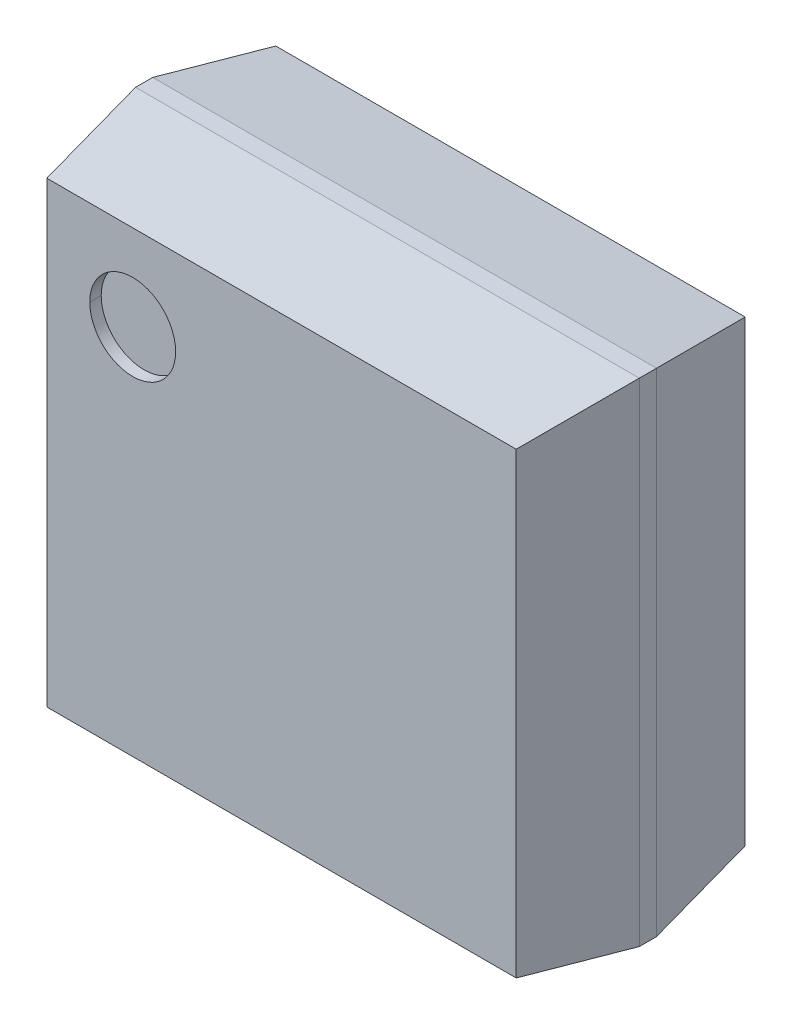
ISO-10303-21;
HEADER;
FILE_DESCRIPTION(('STEP AP214'),'2;1');
FILE_NAME('part.step','',(''),(''),'','','');
FILE_SCHEMA(('AUTOMOTIVE_DESIGN { 1 0 10303 214 1 1 1 1 }'));
ENDSEC;
DATA;
#1=APPLICATION_CONTEXT('core data for automotive mechanical design processes');
#2=APPLICATION_PROTOCOL_DEFINITION('international standard','automotive_design',2000,#1);
#3=PRODUCT_CONTEXT('',#1,'mechanical');
#4=PRODUCT('Part','Part','',(#3));
#5=PRODUCT_RELATED_PRODUCT_CATEGORY('part','',(#4));
#6=PRODUCT_DEFINITION_FORMATION('','',#4);
#7=PRODUCT_DEFINITION_CONTEXT('part definition',#1,'design');
#8=PRODUCT_DEFINITION('design','',#6,#7);
#9=PRODUCT_DEFINITION_SHAPE('','',#8);
#10=(LENGTH_UNIT() NAMED_UNIT(*) SI_UNIT(.MILLI.,.METRE.));
#11=(NAMED_UNIT(*) PLANE_ANGLE_UNIT() SI_UNIT($,.RADIAN.));
#12=(NAMED_UNIT(*) SI_UNIT($,.STERADIAN.) SOLID_ANGLE_UNIT());
#13=UNCERTAINTY_MEASURE_WITH_UNIT(LENGTH_MEASURE(1.E-05),#10,'distance_accuracy_value','');
#14=(GEOMETRIC_REPRESENTATION_CONTEXT(3) GLOBAL_UNCERTAINTY_ASSIGNED_CONTEXT((#13)) GLOBAL_UNIT_ASSIGNED_CONTEXT((#10,
#11,#12)) REPRESENTATION_CONTEXT('',''));
#15=CARTESIAN_POINT('',(0.,0.,0.));
#16=DIRECTION('',(0.,0.,1.));
#17=DIRECTION('',(1.,0.,0.));
#18=AXIS2_PLACEMENT_3D('',#15,#16,#17);
#19=CARTESIAN_POINT('',(0.,0.,2.));
#20=DIRECTION('',(0.,0.,1.));
#21=DIRECTION('',(1.,0.,0.));
#22=AXIS2_PLACEMENT_3D('',#19,#20,#21);
#23=PLANE('',#22);
#24=CARTESIAN_POINT('',(-1.3,1.25,2.));
#25=DIRECTION('',(0.,0.,1.));
#26=DIRECTION('',(1.,0.,0.));
#27=AXIS2_PLACEMENT_3D('',#24,#25,#26);
#28=CIRCLE('',#27,0.375);
#29=CARTESIAN_POINT('',(-0.925,1.25,2.));
#30=VERTEX_POINT('',#29);
#31=CARTESIAN_POINT('',(-1.675,1.25,2.));
#32=VERTEX_POINT('',#31);
#33=EDGE_CURVE('E11',#30,#32,#28,.T.);
#34=ORIENTED_EDGE('',*,*,#33,.T.);
#35=CARTESIAN_POINT('',(-1.3,1.25,2.));
#36=DIRECTION('',(0.,0.,1.));
#37=DIRECTION('',(1.,0.,0.));
#38=AXIS2_PLACEMENT_3D('',#35,#36,#37);
#39=CIRCLE('',#38,0.375);
#40=EDGE_CURVE('E787',#32,#30,#39,.T.);
#41=ORIENTED_EDGE('',*,*,#40,.T.);
#42=EDGE_LOOP('',(#34,#41));
#43=FACE_BOUND('',#42,.T.);
#44=ADVANCED_FACE('F17',(#43),#23,.T.);
#45=CARTESIAN_POINT('',(-1.3,1.25,2.1));
#46=DIRECTION('',(0.,0.,1.));
#47=DIRECTION('',(1.,0.,0.));
#48=AXIS2_PLACEMENT_3D('',#45,#46,#47);
#49=CYLINDRICAL_SURFACE('',#48,0.375);
#50=DIRECTION('',(0.,0.,1.));
#51=VECTOR('',#50,1.);
#52=CARTESIAN_POINT('',(-1.675,1.25,2.1));
#53=LINE('',#52,#51);
#54=CARTESIAN_POINT('',(-1.675,1.25,2.1));
#55=VERTEX_POINT('',#54);
#56=EDGE_CURVE('E791',#32,#55,#53,.T.);
#57=ORIENTED_EDGE('',*,*,#56,.F.);
#58=ORIENTED_EDGE('',*,*,#33,.F.);
#59=DIRECTION('',(0.,0.,1.));
#60=VECTOR('',#59,1.);
#61=CARTESIAN_POINT('',(-0.925,1.25,2.1));
#62=LINE('',#61,#60);
#63=CARTESIAN_POINT('',(-0.925,1.25,2.1));
#64=VERTEX_POINT('',#63);
#65=EDGE_CURVE('E156',#30,#64,#62,.T.);
#66=ORIENTED_EDGE('',*,*,#65,.T.);
#67=CARTESIAN_POINT('',(-1.3,1.25,2.1));
#68=DIRECTION('',(0.,0.,-1.));
#69=DIRECTION('',(1.,0.,0.));
#70=AXIS2_PLACEMENT_3D('',#67,#68,#69);
#71=CIRCLE('',#70,0.375);
#72=EDGE_CURVE('E25',#55,#64,#71,.T.);
#73=ORIENTED_EDGE('',*,*,#72,.F.);
#74=EDGE_LOOP('',(#57,#58,#66,#73));
#75=FACE_BOUND('',#74,.T.);
#76=ADVANCED_FACE('F487',(#75),#49,.F.);
#77=CARTESIAN_POINT('',(0.,0.,2.1));
#78=DIRECTION('',(0.,0.,1.));
#79=DIRECTION('',(1.,0.,0.));
#80=AXIS2_PLACEMENT_3D('',#77,#78,#79);
#81=PLANE('',#80);
#82=CARTESIAN_POINT('',(-1.3,1.25,2.1));
#83=DIRECTION('',(0.,0.,-1.));
#84=DIRECTION('',(1.,0.,0.));
#85=AXIS2_PLACEMENT_3D('',#82,#83,#84);
#86=CIRCLE('',#85,0.375);
#87=EDGE_CURVE('E795',#64,#55,#86,.T.);
#88=ORIENTED_EDGE('',*,*,#87,.T.);
#89=ORIENTED_EDGE('',*,*,#72,.T.);
#90=EDGE_LOOP('',(#88,#89));
#91=FACE_BOUND('',#90,.T.);
#92=DIRECTION('',(1.,0.,0.));
#93=VECTOR('',#92,1.);
#94=CARTESIAN_POINT('',(2.2,-2.,2.1));
#95=LINE('',#94,#93);
#96=CARTESIAN_POINT('',(-2.05,-2.,2.1));
#97=VERTEX_POINT('',#96);
#98=CARTESIAN_POINT('',(2.05,-2.,2.1));
#99=VERTEX_POINT('',#98);
#100=EDGE_CURVE('E46',#97,#99,#95,.T.);
#101=ORIENTED_EDGE('',*,*,#100,.T.);
#102=DIRECTION('',(0.,1.,0.));
#103=VECTOR('',#102,1.);
#104=CARTESIAN_POINT('',(2.05,-2.15,2.1));
#105=LINE('',#104,#103);
#106=CARTESIAN_POINT('',(2.05,2.,2.1));
#107=VERTEX_POINT('',#106);
#108=EDGE_CURVE('E175',#99,#107,#105,.T.);
#109=ORIENTED_EDGE('',*,*,#108,.T.);
#110=DIRECTION('',(-1.,0.,0.));
#111=VECTOR('',#110,1.);
#112=CARTESIAN_POINT('',(2.2,2.,2.1));
#113=LINE('',#112,#111);
#114=CARTESIAN_POINT('',(-2.05,2.,2.1));
#115=VERTEX_POINT('',#114);
#116=EDGE_CURVE('E184',#107,#115,#113,.T.);
#117=ORIENTED_EDGE('',*,*,#116,.T.);
#118=DIRECTION('',(0.,-1.,0.));
#119=VECTOR('',#118,1.);
#120=CARTESIAN_POINT('',(-2.05,-2.15,2.1));
#121=LINE('',#120,#119);
#122=EDGE_CURVE('E38',#115,#97,#121,.T.);
#123=ORIENTED_EDGE('',*,*,#122,.T.);
#124=EDGE_LOOP('',(#101,#109,#117,#123));
#125=FACE_BOUND('',#124,.T.);
#126=ADVANCED_FACE('F491',(#91,#125),#81,.T.);
#127=CARTESIAN_POINT('',(-2.125,-2.15,1.6375));
#128=DIRECTION('',(0.987105477747585,0.,-0.160071158553662));
#129=DIRECTION('',(0.,-1.,0.));
#130=AXIS2_PLACEMENT_3D('',#127,#128,#129);
#131=PLANE('',#130);
#132=DIRECTION('',(0.,1.,0.));
#133=VECTOR('',#132,1.);
#134=CARTESIAN_POINT('',(-2.2,0.,1.175));
#135=LINE('',#134,#133);
#136=CARTESIAN_POINT('',(-2.2,-2.15,1.175));
#137=VERTEX_POINT('',#136);
#138=CARTESIAN_POINT('',(-2.2,2.15,1.175));
#139=VERTEX_POINT('',#138);
#140=EDGE_CURVE('E180',#137,#139,#135,.T.);
#141=ORIENTED_EDGE('',*,*,#140,.F.);
#142=DIRECTION('',(0.15805901093215,0.158059010932149,0.97469723408159));
#143=VECTOR('',#142,1.);
#144=CARTESIAN_POINT('',(-2.2,-2.15,1.175));
#145=LINE('',#144,#143);
#146=EDGE_CURVE('E195',#137,#97,#145,.T.);
#147=ORIENTED_EDGE('',*,*,#146,.T.);
#148=ORIENTED_EDGE('',*,*,#122,.F.);
#149=DIRECTION('',(-0.15805901093215,0.15805901093215,-0.97469723408159));
#150=VECTOR('',#149,1.);
#151=CARTESIAN_POINT('',(-2.05,2.,2.1));
#152=LINE('',#151,#150);
#153=EDGE_CURVE('E219',#115,#139,#152,.T.);
#154=ORIENTED_EDGE('',*,*,#153,.T.);
#155=EDGE_LOOP('',(#141,#147,#148,#154));
#156=FACE_BOUND('',#155,.T.);
#157=ADVANCED_FACE('F534',(#156),#131,.F.);
#158=CARTESIAN_POINT('',(2.2,-2.075,1.6375));
#159=DIRECTION('',(0.,0.987105477747585,-0.160071158553662));
#160=DIRECTION('',(-1.,0.,0.));
#161=AXIS2_PLACEMENT_3D('',#158,#159,#160);
#162=PLANE('',#161);
#163=DIRECTION('',(-1.,0.,0.));
#164=VECTOR('',#163,1.);
#165=CARTESIAN_POINT('',(0.,-2.15,1.175));
#166=LINE('',#165,#164);
#167=CARTESIAN_POINT('',(2.2,-2.15,1.175));
#168=VERTEX_POINT('',#167);
#169=EDGE_CURVE('E210',#168,#137,#166,.T.);
#170=ORIENTED_EDGE('',*,*,#169,.F.);
#171=DIRECTION('',(-0.158059010932149,0.15805901093215,0.97469723408159));
#172=VECTOR('',#171,1.);
#173=CARTESIAN_POINT('',(2.2,-2.15,1.175));
#174=LINE('',#173,#172);
#175=EDGE_CURVE('E172',#168,#99,#174,.T.);
#176=ORIENTED_EDGE('',*,*,#175,.T.);
#177=ORIENTED_EDGE('',*,*,#100,.F.);
#178=ORIENTED_EDGE('',*,*,#146,.F.);
#179=EDGE_LOOP('',(#170,#176,#177,#178));
#180=FACE_BOUND('',#179,.T.);
#181=ADVANCED_FACE('F525',(#180),#162,.F.);
#182=CARTESIAN_POINT('',(2.125,-2.15,1.6375));
#183=DIRECTION('',(-0.987105477747585,0.,-0.160071158553662));
#184=DIRECTION('',(-0.160071158553662,0.,0.987105477747585));
#185=AXIS2_PLACEMENT_3D('',#182,#183,#184);
#186=PLANE('',#185);
#187=ORIENTED_EDGE('',*,*,#108,.F.);
#188=ORIENTED_EDGE('',*,*,#175,.F.);
#189=DIRECTION('',(0.,-1.,0.));
#190=VECTOR('',#189,1.);
#191=CARTESIAN_POINT('',(2.2,0.,1.175));
#192=LINE('',#191,#190);
#193=CARTESIAN_POINT('',(2.2,2.15,1.175));
#194=VERTEX_POINT('',#193);
#195=EDGE_CURVE('E203',#194,#168,#192,.T.);
#196=ORIENTED_EDGE('',*,*,#195,.F.);
#197=DIRECTION('',(-0.15805901093215,-0.15805901093215,0.97469723408159));
#198=VECTOR('',#197,1.);
#199=CARTESIAN_POINT('',(2.2,2.15,1.175));
#200=LINE('',#199,#198);
#201=EDGE_CURVE('E215',#194,#107,#200,.T.);
#202=ORIENTED_EDGE('',*,*,#201,.T.);
#203=EDGE_LOOP('',(#187,#188,#196,#202));
#204=FACE_BOUND('',#203,.T.);
#205=ADVANCED_FACE('F454',(#204),#186,.F.);
#206=CARTESIAN_POINT('',(2.2,2.075,1.6375));
#207=DIRECTION('',(0.,-0.987105477747585,-0.160071158553662));
#208=DIRECTION('',(0.,0.160071158553662,-0.987105477747585));
#209=AXIS2_PLACEMENT_3D('',#206,#207,#208);
#210=PLANE('',#209);
#211=ORIENTED_EDGE('',*,*,#116,.F.);
#212=ORIENTED_EDGE('',*,*,#201,.F.);
#213=DIRECTION('',(1.,0.,0.));
#214=VECTOR('',#213,1.);
#215=CARTESIAN_POINT('',(0.,2.15,1.175));
#216=LINE('',#215,#214);
#217=EDGE_CURVE('E160',#139,#194,#216,.T.);
#218=ORIENTED_EDGE('',*,*,#217,.F.);
#219=ORIENTED_EDGE('',*,*,#153,.F.);
#220=EDGE_LOOP('',(#211,#212,#218,#219));
#221=FACE_BOUND('',#220,.T.);
#222=ADVANCED_FACE('F449',(#221),#210,.F.);
#223=CARTESIAN_POINT('',(-2.2,0.,1.1));
#224=DIRECTION('',(-1.,0.,0.));
#225=DIRECTION('',(0.,0.,1.));
#226=AXIS2_PLACEMENT_3D('',#223,#224,#225);
#227=PLANE('',#226);
#228=DIRECTION('',(0.,-1.,0.));
#229=VECTOR('',#228,1.);
#230=CARTESIAN_POINT('',(-2.2,-2.15,1.025));
#231=LINE('',#230,#229);
#232=CARTESIAN_POINT('',(-2.2,2.15,1.025));
#233=VERTEX_POINT('',#232);
#234=CARTESIAN_POINT('',(-2.2,-2.15,1.025));
#235=VERTEX_POINT('',#234);
#236=EDGE_CURVE('E134',#233,#235,#231,.T.);
#237=ORIENTED_EDGE('',*,*,#236,.T.);
#238=DIRECTION('',(0.,0.,-1.));
#239=VECTOR('',#238,1.);
#240=CARTESIAN_POINT('',(-2.2,-2.15,1.1));
#241=LINE('',#240,#239);
#242=EDGE_CURVE('E185',#137,#235,#241,.T.);
#243=ORIENTED_EDGE('',*,*,#242,.F.);
#244=ORIENTED_EDGE('',*,*,#140,.T.);
#245=DIRECTION('',(0.,0.,1.));
#246=VECTOR('',#245,1.);
#247=CARTESIAN_POINT('',(-2.2,2.15,1.1));
#248=LINE('',#247,#246);
#249=EDGE_CURVE('E165',#233,#139,#248,.T.);
#250=ORIENTED_EDGE('',*,*,#249,.F.);
#251=EDGE_LOOP('',(#237,#243,#244,#250));
#252=FACE_BOUND('',#251,.T.);
#253=ADVANCED_FACE('F453',(#252),#227,.T.);
#254=CARTESIAN_POINT('',(0.,-2.15,1.1));
#255=DIRECTION('',(0.,-1.,0.));
#256=DIRECTION('',(-1.,0.,0.));
#257=AXIS2_PLACEMENT_3D('',#254,#255,#256);
#258=PLANE('',#257);
#259=DIRECTION('',(1.,0.,0.));
#260=VECTOR('',#259,1.);
#261=CARTESIAN_POINT('',(2.2,-2.15,1.025));
#262=LINE('',#261,#260);
#263=CARTESIAN_POINT('',(2.2,-2.15,1.025));
#264=VERTEX_POINT('',#263);
#265=EDGE_CURVE('E130',#235,#264,#262,.T.);
#266=ORIENTED_EDGE('',*,*,#265,.T.);
#267=DIRECTION('',(0.,0.,-1.));
#268=VECTOR('',#267,1.);
#269=CARTESIAN_POINT('',(2.2,-2.15,1.1));
#270=LINE('',#269,#268);
#271=EDGE_CURVE('E207',#168,#264,#270,.T.);
#272=ORIENTED_EDGE('',*,*,#271,.F.);
#273=ORIENTED_EDGE('',*,*,#169,.T.);
#274=ORIENTED_EDGE('',*,*,#242,.T.);
#275=EDGE_LOOP('',(#266,#272,#273,#274));
#276=FACE_BOUND('',#275,.T.);
#277=ADVANCED_FACE('F478',(#276),#258,.T.);
#278=CARTESIAN_POINT('',(2.2,0.,1.1));
#279=DIRECTION('',(1.,0.,0.));
#280=DIRECTION('',(0.,1.,0.));
#281=AXIS2_PLACEMENT_3D('',#278,#279,#280);
#282=PLANE('',#281);
#283=DIRECTION('',(0.,1.,0.));
#284=VECTOR('',#283,1.);
#285=CARTESIAN_POINT('',(2.2,-2.15,1.025));
#286=LINE('',#285,#284);
#287=CARTESIAN_POINT('',(2.2,2.15,1.025));
#288=VERTEX_POINT('',#287);
#289=EDGE_CURVE('E166',#264,#288,#286,.T.);
#290=ORIENTED_EDGE('',*,*,#289,.T.);
#291=DIRECTION('',(0.,0.,-1.));
#292=VECTOR('',#291,1.);
#293=CARTESIAN_POINT('',(2.2,2.15,1.1));
#294=LINE('',#293,#292);
#295=EDGE_CURVE('E164',#194,#288,#294,.T.);
#296=ORIENTED_EDGE('',*,*,#295,.F.);
#297=ORIENTED_EDGE('',*,*,#195,.T.);
#298=ORIENTED_EDGE('',*,*,#271,.T.);
#299=EDGE_LOOP('',(#290,#296,#297,#298));
#300=FACE_BOUND('',#299,.T.);
#301=ADVANCED_FACE('F466',(#300),#282,.T.);
#302=CARTESIAN_POINT('',(0.,2.15,1.1));
#303=DIRECTION('',(0.,1.,0.));
#304=DIRECTION('',(1.,0.,0.));
#305=AXIS2_PLACEMENT_3D('',#302,#303,#304);
#306=PLANE('',#305);
#307=DIRECTION('',(-1.,0.,0.));
#308=VECTOR('',#307,1.);
#309=CARTESIAN_POINT('',(2.2,2.15,1.025));
#310=LINE('',#309,#308);
#311=EDGE_CURVE('E188',#288,#233,#310,.T.);
#312=ORIENTED_EDGE('',*,*,#311,.T.);
#313=ORIENTED_EDGE('',*,*,#249,.T.);
#314=ORIENTED_EDGE('',*,*,#217,.T.);
#315=ORIENTED_EDGE('',*,*,#295,.T.);
#316=EDGE_LOOP('',(#312,#313,#314,#315));
#317=FACE_BOUND('',#316,.T.);
#318=ADVANCED_FACE('F441',(#317),#306,.T.);
#319=CARTESIAN_POINT('',(-2.125,-2.15,0.5625));
#320=DIRECTION('',(0.987105477747585,0.,0.160071158553662));
#321=DIRECTION('',(0.,-1.,0.));
#322=AXIS2_PLACEMENT_3D('',#319,#320,#321);
#323=PLANE('',#322);
#324=DIRECTION('',(0.,-1.,0.));
#325=VECTOR('',#324,1.);
#326=CARTESIAN_POINT('',(-2.05,0.,0.1));
#327=LINE('',#326,#325);
#328=CARTESIAN_POINT('',(-2.05,2.,0.1));
#329=VERTEX_POINT('',#328);
#330=CARTESIAN_POINT('',(-2.05,-2.,0.1));
#331=VERTEX_POINT('',#330);
#332=EDGE_CURVE('E137',#329,#331,#327,.T.);
#333=ORIENTED_EDGE('',*,*,#332,.T.);
#334=DIRECTION('',(-0.158059010932151,-0.158059010932149,0.97469723408159));
#335=VECTOR('',#334,1.);
#336=CARTESIAN_POINT('',(-2.05,-2.,0.1));
#337=LINE('',#336,#335);
#338=EDGE_CURVE('E122',#331,#235,#337,.T.);
#339=ORIENTED_EDGE('',*,*,#338,.T.);
#340=ORIENTED_EDGE('',*,*,#236,.F.);
#341=DIRECTION('',(0.158059010932148,-0.158059010932149,-0.97469723408159));
#342=VECTOR('',#341,1.);
#343=CARTESIAN_POINT('',(-2.2,2.15,1.025));
#344=LINE('',#343,#342);
#345=EDGE_CURVE('E140',#233,#329,#344,.T.);
#346=ORIENTED_EDGE('',*,*,#345,.T.);
#347=EDGE_LOOP('',(#333,#339,#340,#346));
#348=FACE_BOUND('',#347,.T.);
#349=ADVANCED_FACE('F138',(#348),#323,.F.);
#350=CARTESIAN_POINT('',(2.2,-2.075,0.5625));
#351=DIRECTION('',(0.,0.987105477747585,0.160071158553662));
#352=DIRECTION('',(1.,0.,0.));
#353=AXIS2_PLACEMENT_3D('',#350,#351,#352);
#354=PLANE('',#353);
#355=DIRECTION('',(0.15805901093215,-0.15805901093215,0.97469723408159));
#356=VECTOR('',#355,1.);
#357=CARTESIAN_POINT('',(2.05,-2.,0.1));
#358=LINE('',#357,#356);
#359=CARTESIAN_POINT('',(2.05,-2.,0.1));
#360=VERTEX_POINT('',#359);
#361=EDGE_CURVE('E169',#360,#264,#358,.T.);
#362=ORIENTED_EDGE('',*,*,#361,.T.);
#363=ORIENTED_EDGE('',*,*,#265,.F.);
#364=ORIENTED_EDGE('',*,*,#338,.F.);
#365=DIRECTION('',(1.,0.,0.));
#366=VECTOR('',#365,1.);
#367=CARTESIAN_POINT('',(0.,-2.,0.1));
#368=LINE('',#367,#366);
#369=EDGE_CURVE('E127',#331,#360,#368,.T.);
#370=ORIENTED_EDGE('',*,*,#369,.T.);
#371=EDGE_LOOP('',(#362,#363,#364,#370));
#372=FACE_BOUND('',#371,.T.);
#373=ADVANCED_FACE('F125',(#372),#354,.F.);
#374=CARTESIAN_POINT('',(2.125,-2.15,0.5625));
#375=DIRECTION('',(-0.987105477747585,0.,0.160071158553662));
#376=DIRECTION('',(0.,1.,0.));
#377=AXIS2_PLACEMENT_3D('',#374,#375,#376);
#378=PLANE('',#377);
#379=ORIENTED_EDGE('',*,*,#289,.F.);
#380=ORIENTED_EDGE('',*,*,#361,.F.);
#381=DIRECTION('',(0.,1.,0.));
#382=VECTOR('',#381,1.);
#383=CARTESIAN_POINT('',(2.05,0.,0.1));
#384=LINE('',#383,#382);
#385=CARTESIAN_POINT('',(2.05,2.,0.1));
#386=VERTEX_POINT('',#385);
#387=EDGE_CURVE('E149',#360,#386,#384,.T.);
#388=ORIENTED_EDGE('',*,*,#387,.T.);
#389=DIRECTION('',(0.158059010932151,0.158059010932149,0.97469723408159));
#390=VECTOR('',#389,1.);
#391=CARTESIAN_POINT('',(2.05,2.,0.1));
#392=LINE('',#391,#390);
#393=EDGE_CURVE('E170',#386,#288,#392,.T.);
#394=ORIENTED_EDGE('',*,*,#393,.T.);
#395=EDGE_LOOP('',(#379,#380,#388,#394));
#396=FACE_BOUND('',#395,.T.);
#397=ADVANCED_FACE('F408',(#396),#378,.F.);
#398=CARTESIAN_POINT('',(2.2,2.075,0.5625));
#399=DIRECTION('',(0.,-0.987105477747585,0.160071158553662));
#400=DIRECTION('',(-1.,0.,0.));
#401=AXIS2_PLACEMENT_3D('',#398,#399,#400);
#402=PLANE('',#401);
#403=DIRECTION('',(-1.,0.,0.));
#404=VECTOR('',#403,1.);
#405=CARTESIAN_POINT('',(0.,2.,0.1));
#406=LINE('',#405,#404);
#407=EDGE_CURVE('E145',#386,#329,#406,.T.);
#408=ORIENTED_EDGE('',*,*,#407,.T.);
#409=ORIENTED_EDGE('',*,*,#345,.F.);
#410=ORIENTED_EDGE('',*,*,#311,.F.);
#411=ORIENTED_EDGE('',*,*,#393,.F.);
#412=EDGE_LOOP('',(#408,#409,#410,#411));
#413=FACE_BOUND('',#412,.T.);
#414=ADVANCED_FACE('F397',(#413),#402,.F.);
#415=CARTESIAN_POINT('',(0.,0.,0.1));
#416=DIRECTION('',(0.,0.,1.));
#417=DIRECTION('',(1.,0.,0.));
#418=AXIS2_PLACEMENT_3D('',#415,#416,#417);
#419=PLANE('',#418);
#420=ORIENTED_EDGE('',*,*,#387,.F.);
#421=ORIENTED_EDGE('',*,*,#369,.F.);
#422=ORIENTED_EDGE('',*,*,#332,.F.);
#423=ORIENTED_EDGE('',*,*,#407,.F.);
#424=EDGE_LOOP('',(#420,#421,#422,#423));
#425=FACE_BOUND('',#424,.T.);
#426=ADVANCED_FACE('F147',(#425),#419,.F.);
#427=CARTESIAN_POINT('',(-1.3,1.25,2.1));
#428=DIRECTION('',(0.,0.,1.));
#429=DIRECTION('',(1.,0.,0.));
#430=AXIS2_PLACEMENT_3D('',#427,#428,#429);
#431=CYLINDRICAL_SURFACE('',#430,0.375);
#432=ORIENTED_EDGE('',*,*,#40,.F.);
#433=ORIENTED_EDGE('',*,*,#56,.T.);
#434=ORIENTED_EDGE('',*,*,#87,.F.);
#435=ORIENTED_EDGE('',*,*,#65,.F.);
#436=EDGE_LOOP('',(#432,#433,#434,#435));
#437=FACE_BOUND('',#436,.T.);
#438=ADVANCED_FACE('F380',(#437),#431,.F.);
#439=CLOSED_SHELL('',(#44,#76,#126,#157,#181,#205,#222,#253,#277,#301,#318,#349,#373,#397,#414,
#426,#438));
#440=MANIFOLD_SOLID_BREP('B1',#439);
#441=ADVANCED_BREP_SHAPE_REPRESENTATION('',(#18,#440),#14);
#442=SHAPE_DEFINITION_REPRESENTATION(#9,#441);
ENDSEC;
END-ISO-10303-21;
